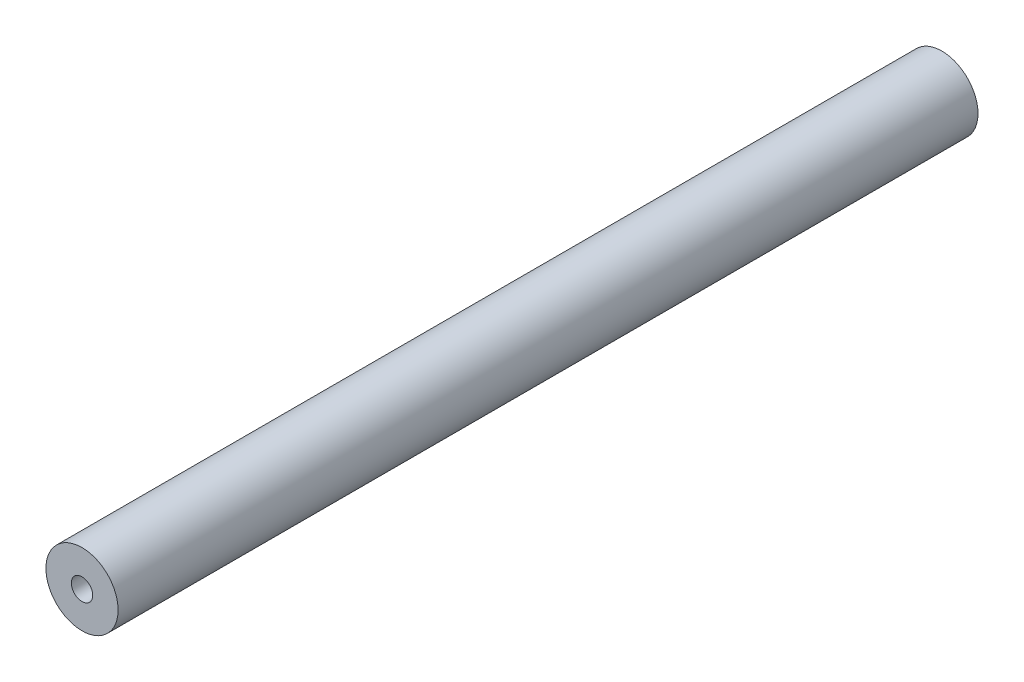
ISO-10303-21;
HEADER;
FILE_DESCRIPTION(('STEP AP214'),'2;1');
FILE_NAME('part.step','',(''),(''),'','','');
FILE_SCHEMA(('AUTOMOTIVE_DESIGN { 1 0 10303 214 1 1 1 1 }'));
ENDSEC;
DATA;
#1=APPLICATION_CONTEXT('core data for automotive mechanical design processes');
#2=APPLICATION_PROTOCOL_DEFINITION('international standard','automotive_design',2000,#1);
#3=PRODUCT_CONTEXT('',#1,'mechanical');
#4=PRODUCT('Part','Part','',(#3));
#5=PRODUCT_RELATED_PRODUCT_CATEGORY('part','',(#4));
#6=PRODUCT_DEFINITION_FORMATION('','',#4);
#7=PRODUCT_DEFINITION_CONTEXT('part definition',#1,'design');
#8=PRODUCT_DEFINITION('design','',#6,#7);
#9=PRODUCT_DEFINITION_SHAPE('','',#8);
#10=(LENGTH_UNIT() NAMED_UNIT(*) SI_UNIT(.MILLI.,.METRE.));
#11=(NAMED_UNIT(*) PLANE_ANGLE_UNIT() SI_UNIT($,.RADIAN.));
#12=(NAMED_UNIT(*) SI_UNIT($,.STERADIAN.) SOLID_ANGLE_UNIT());
#13=UNCERTAINTY_MEASURE_WITH_UNIT(LENGTH_MEASURE(1.E-05),#10,'distance_accuracy_value','');
#14=(GEOMETRIC_REPRESENTATION_CONTEXT(3) GLOBAL_UNCERTAINTY_ASSIGNED_CONTEXT((#13)) GLOBAL_UNIT_ASSIGNED_CONTEXT((#10,
#11,#12)) REPRESENTATION_CONTEXT('',''));
#15=CARTESIAN_POINT('',(0.,0.,0.));
#16=DIRECTION('',(0.,0.,1.));
#17=DIRECTION('',(1.,0.,0.));
#18=AXIS2_PLACEMENT_3D('',#15,#16,#17);
#19=CARTESIAN_POINT('',(0.,0.,152.53));
#20=DIRECTION('',(0.,0.,-1.));
#21=DIRECTION('',(-1.,0.,0.));
#22=AXIS2_PLACEMENT_3D('',#19,#20,#21);
#23=CYLINDRICAL_SURFACE('',#22,6.4);
#24=CARTESIAN_POINT('',(0.,0.,152.53));
#25=DIRECTION('',(0.,0.,1.));
#26=DIRECTION('',(1.,0.,0.));
#27=AXIS2_PLACEMENT_3D('',#24,#25,#26);
#28=CIRCLE('',#27,6.4);
#29=CARTESIAN_POINT('',(6.4,0.,152.53));
#30=VERTEX_POINT('',#29);
#31=EDGE_CURVE('E11',#30,#30,#28,.T.);
#32=ORIENTED_EDGE('',*,*,#31,.F.);
#33=EDGE_LOOP('',(#32));
#34=FACE_BOUND('',#33,.T.);
#35=CARTESIAN_POINT('',(0.,0.,0.));
#36=DIRECTION('',(0.,0.,1.));
#37=DIRECTION('',(1.,0.,0.));
#38=AXIS2_PLACEMENT_3D('',#35,#36,#37);
#39=CIRCLE('',#38,6.4);
#40=CARTESIAN_POINT('',(6.4,0.,0.));
#41=VERTEX_POINT('',#40);
#42=EDGE_CURVE('E38',#41,#41,#39,.T.);
#43=ORIENTED_EDGE('',*,*,#42,.T.);
#44=EDGE_LOOP('',(#43));
#45=FACE_BOUND('',#44,.T.);
#46=ADVANCED_FACE('F35',(#34,#45),#23,.T.);
#47=CARTESIAN_POINT('',(0.,0.,152.53));
#48=DIRECTION('',(0.,0.,1.));
#49=DIRECTION('',(1.,0.,0.));
#50=AXIS2_PLACEMENT_3D('',#47,#48,#49);
#51=PLANE('',#50);
#52=CARTESIAN_POINT('',(0.,0.,152.53));
#53=DIRECTION('',(0.,0.,1.));
#54=DIRECTION('',(1.,0.,0.));
#55=AXIS2_PLACEMENT_3D('',#52,#53,#54);
#56=CIRCLE('',#55,1.89865);
#57=CARTESIAN_POINT('',(1.89865,0.,152.53));
#58=VERTEX_POINT('',#57);
#59=EDGE_CURVE('E59',#58,#58,#56,.T.);
#60=ORIENTED_EDGE('',*,*,#59,.F.);
#61=EDGE_LOOP('',(#60));
#62=FACE_BOUND('',#61,.T.);
#63=ORIENTED_EDGE('',*,*,#31,.T.);
#64=EDGE_LOOP('',(#63));
#65=FACE_BOUND('',#64,.T.);
#66=ADVANCED_FACE('F77',(#62,#65),#51,.T.);
#67=CARTESIAN_POINT('',(0.,0.,0.));
#68=DIRECTION('',(0.,0.,1.));
#69=DIRECTION('',(1.,0.,0.));
#70=AXIS2_PLACEMENT_3D('',#67,#68,#69);
#71=PLANE('',#70);
#72=CARTESIAN_POINT('',(0.,0.,0.));
#73=DIRECTION('',(0.,0.,-1.));
#74=DIRECTION('',(-1.,0.,0.));
#75=AXIS2_PLACEMENT_3D('',#72,#73,#74);
#76=CIRCLE('',#75,1.89865);
#77=CARTESIAN_POINT('',(-1.89865,0.,0.));
#78=VERTEX_POINT('',#77);
#79=EDGE_CURVE('E58',#78,#78,#76,.T.);
#80=ORIENTED_EDGE('',*,*,#79,.F.);
#81=EDGE_LOOP('',(#80));
#82=FACE_BOUND('',#81,.T.);
#83=ORIENTED_EDGE('',*,*,#42,.F.);
#84=EDGE_LOOP('',(#83));
#85=FACE_BOUND('',#84,.T.);
#86=ADVANCED_FACE('F74',(#82,#85),#71,.F.);
#87=CARTESIAN_POINT('',(0.,0.,12.83));
#88=DIRECTION('',(0.,0.,-1.));
#89=DIRECTION('',(-1.,0.,0.));
#90=AXIS2_PLACEMENT_3D('',#87,#88,#89);
#91=CONICAL_SURFACE('',#90,1.89864999999999,1.02974425867665);
#92=CARTESIAN_POINT('',(0.,0.,13.9708240143167));
#93=VERTEX_POINT('',#92);
#94=VERTEX_LOOP('',#93);
#95=FACE_BOUND('',#94,.T.);
#96=CARTESIAN_POINT('',(0.,0.,12.83));
#97=DIRECTION('',(0.,0.,-1.));
#98=DIRECTION('',(-1.,0.,0.));
#99=AXIS2_PLACEMENT_3D('',#96,#97,#98);
#100=CIRCLE('',#99,1.89864999999999);
#101=CARTESIAN_POINT('',(-1.89864999999999,0.,12.83));
#102=VERTEX_POINT('',#101);
#103=EDGE_CURVE('E62',#102,#102,#100,.T.);
#104=ORIENTED_EDGE('',*,*,#103,.T.);
#105=EDGE_LOOP('',(#104));
#106=FACE_BOUND('',#105,.T.);
#107=ADVANCED_FACE('F76',(#95,#106),#91,.F.);
#108=CARTESIAN_POINT('',(0.,0.,0.));
#109=DIRECTION('',(0.,0.,-1.));
#110=DIRECTION('',(-1.,0.,0.));
#111=AXIS2_PLACEMENT_3D('',#108,#109,#110);
#112=CYLINDRICAL_SURFACE('',#111,1.89865);
#113=ORIENTED_EDGE('',*,*,#103,.F.);
#114=EDGE_LOOP('',(#113));
#115=FACE_BOUND('',#114,.T.);
#116=ORIENTED_EDGE('',*,*,#79,.T.);
#117=EDGE_LOOP('',(#116));
#118=FACE_BOUND('',#117,.T.);
#119=ADVANCED_FACE('F52',(#115,#118),#112,.F.);
#120=CARTESIAN_POINT('',(0.,0.,139.7));
#121=DIRECTION('',(0.,0.,1.));
#122=DIRECTION('',(1.,0.,0.));
#123=AXIS2_PLACEMENT_3D('',#120,#121,#122);
#124=CONICAL_SURFACE('',#123,1.89864999999999,1.02974425867665);
#125=CARTESIAN_POINT('',(0.,0.,138.559175985683));
#126=VERTEX_POINT('',#125);
#127=VERTEX_LOOP('',#126);
#128=FACE_BOUND('',#127,.T.);
#129=CARTESIAN_POINT('',(0.,0.,139.7));
#130=DIRECTION('',(0.,0.,1.));
#131=DIRECTION('',(1.,0.,0.));
#132=AXIS2_PLACEMENT_3D('',#129,#130,#131);
#133=CIRCLE('',#132,1.89864999999999);
#134=CARTESIAN_POINT('',(1.89864999999999,0.,139.7));
#135=VERTEX_POINT('',#134);
#136=EDGE_CURVE('E56',#135,#135,#133,.T.);
#137=ORIENTED_EDGE('',*,*,#136,.T.);
#138=EDGE_LOOP('',(#137));
#139=FACE_BOUND('',#138,.T.);
#140=ADVANCED_FACE('F48',(#128,#139),#124,.F.);
#141=CARTESIAN_POINT('',(0.,0.,152.53));
#142=DIRECTION('',(0.,0.,1.));
#143=DIRECTION('',(1.,0.,0.));
#144=AXIS2_PLACEMENT_3D('',#141,#142,#143);
#145=CYLINDRICAL_SURFACE('',#144,1.89865);
#146=ORIENTED_EDGE('',*,*,#136,.F.);
#147=EDGE_LOOP('',(#146));
#148=FACE_BOUND('',#147,.T.);
#149=ORIENTED_EDGE('',*,*,#59,.T.);
#150=EDGE_LOOP('',(#149));
#151=FACE_BOUND('',#150,.T.);
#152=ADVANCED_FACE('F51',(#148,#151),#145,.F.);
#153=CLOSED_SHELL('',(#46,#66,#86,#107,#119,#140,#152));
#154=MANIFOLD_SOLID_BREP('B2',#153);
#155=ADVANCED_BREP_SHAPE_REPRESENTATION('',(#18,#154),#14);
#156=SHAPE_DEFINITION_REPRESENTATION(#9,#155);
ENDSEC;
END-ISO-10303-21;
